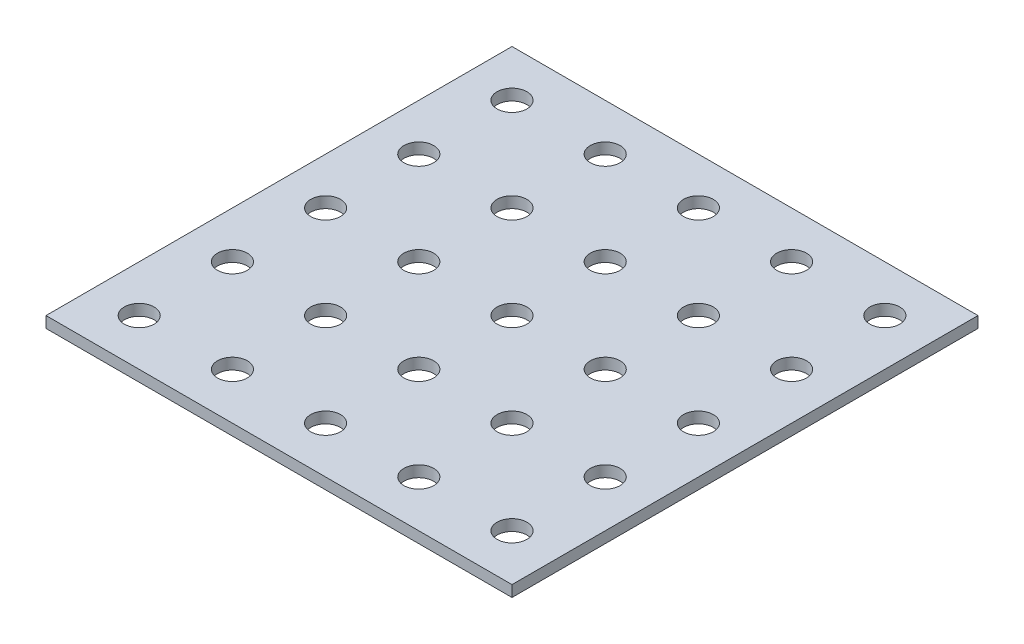
ISO-10303-21;
HEADER;
FILE_DESCRIPTION(('STEP AP214'),'2;1');
FILE_NAME('part.step','',(''),(''),'','','');
FILE_SCHEMA(('AUTOMOTIVE_DESIGN { 1 0 10303 214 1 1 1 1 }'));
ENDSEC;
DATA;
#1=APPLICATION_CONTEXT('core data for automotive mechanical design processes');
#2=APPLICATION_PROTOCOL_DEFINITION('international standard','automotive_design',2000,#1);
#3=PRODUCT_CONTEXT('',#1,'mechanical');
#4=PRODUCT('Part','Part','',(#3));
#5=PRODUCT_RELATED_PRODUCT_CATEGORY('part','',(#4));
#6=PRODUCT_DEFINITION_FORMATION('','',#4);
#7=PRODUCT_DEFINITION_CONTEXT('part definition',#1,'design');
#8=PRODUCT_DEFINITION('design','',#6,#7);
#9=PRODUCT_DEFINITION_SHAPE('','',#8);
#10=(LENGTH_UNIT() NAMED_UNIT(*) SI_UNIT(.MILLI.,.METRE.));
#11=(NAMED_UNIT(*) PLANE_ANGLE_UNIT() SI_UNIT($,.RADIAN.));
#12=(NAMED_UNIT(*) SI_UNIT($,.STERADIAN.) SOLID_ANGLE_UNIT());
#13=UNCERTAINTY_MEASURE_WITH_UNIT(LENGTH_MEASURE(1.E-05),#10,'distance_accuracy_value','');
#14=(GEOMETRIC_REPRESENTATION_CONTEXT(3) GLOBAL_UNCERTAINTY_ASSIGNED_CONTEXT((#13)) GLOBAL_UNIT_ASSIGNED_CONTEXT((#10,
#11,#12)) REPRESENTATION_CONTEXT('',''));
#15=CARTESIAN_POINT('',(0.,0.,0.));
#16=DIRECTION('',(0.,0.,1.));
#17=DIRECTION('',(1.,0.,0.));
#18=AXIS2_PLACEMENT_3D('',#15,#16,#17);
#19=CARTESIAN_POINT('',(-125.,6.,-125.));
#20=DIRECTION('',(1.,0.,0.));
#21=DIRECTION('',(0.,0.,-1.));
#22=AXIS2_PLACEMENT_3D('',#19,#20,#21);
#23=PLANE('',#22);
#24=DIRECTION('',(0.,0.,1.));
#25=VECTOR('',#24,1.);
#26=CARTESIAN_POINT('',(-125.,0.,-125.));
#27=LINE('',#26,#25);
#28=CARTESIAN_POINT('',(-125.,0.,-125.));
#29=VERTEX_POINT('',#28);
#30=CARTESIAN_POINT('',(-125.,0.,125.));
#31=VERTEX_POINT('',#30);
#32=EDGE_CURVE('E99',#29,#31,#27,.T.);
#33=ORIENTED_EDGE('',*,*,#32,.T.);
#34=DIRECTION('',(0.,-1.,0.));
#35=VECTOR('',#34,1.);
#36=CARTESIAN_POINT('',(-125.,6.,125.));
#37=LINE('',#36,#35);
#38=CARTESIAN_POINT('',(-125.,6.,125.));
#39=VERTEX_POINT('',#38);
#40=EDGE_CURVE('E11',#39,#31,#37,.T.);
#41=ORIENTED_EDGE('',*,*,#40,.F.);
#42=DIRECTION('',(0.,0.,1.));
#43=VECTOR('',#42,1.);
#44=CARTESIAN_POINT('',(-125.,6.,-125.));
#45=LINE('',#44,#43);
#46=CARTESIAN_POINT('',(-125.,6.,-125.));
#47=VERTEX_POINT('',#46);
#48=EDGE_CURVE('E87',#47,#39,#45,.T.);
#49=ORIENTED_EDGE('',*,*,#48,.F.);
#50=DIRECTION('',(0.,-1.,0.));
#51=VECTOR('',#50,1.);
#52=CARTESIAN_POINT('',(-125.,6.,-125.));
#53=LINE('',#52,#51);
#54=EDGE_CURVE('E95',#47,#29,#53,.T.);
#55=ORIENTED_EDGE('',*,*,#54,.T.);
#56=EDGE_LOOP('',(#33,#41,#49,#55));
#57=FACE_BOUND('',#56,.T.);
#58=ADVANCED_FACE('F36',(#57),#23,.F.);
#59=CARTESIAN_POINT('',(125.,6.,125.));
#60=DIRECTION('',(0.,0.,-1.));
#61=DIRECTION('',(-1.,0.,0.));
#62=AXIS2_PLACEMENT_3D('',#59,#60,#61);
#63=PLANE('',#62);
#64=DIRECTION('',(1.,0.,0.));
#65=VECTOR('',#64,1.);
#66=CARTESIAN_POINT('',(125.,0.,125.));
#67=LINE('',#66,#65);
#68=CARTESIAN_POINT('',(125.,0.,125.));
#69=VERTEX_POINT('',#68);
#70=EDGE_CURVE('E91',#31,#69,#67,.T.);
#71=ORIENTED_EDGE('',*,*,#70,.T.);
#72=DIRECTION('',(0.,-1.,0.));
#73=VECTOR('',#72,1.);
#74=CARTESIAN_POINT('',(125.,6.,125.));
#75=LINE('',#74,#73);
#76=CARTESIAN_POINT('',(125.,6.,125.));
#77=VERTEX_POINT('',#76);
#78=EDGE_CURVE('E44',#77,#69,#75,.T.);
#79=ORIENTED_EDGE('',*,*,#78,.F.);
#80=DIRECTION('',(1.,0.,0.));
#81=VECTOR('',#80,1.);
#82=CARTESIAN_POINT('',(125.,6.,125.));
#83=LINE('',#82,#81);
#84=EDGE_CURVE('E82',#39,#77,#83,.T.);
#85=ORIENTED_EDGE('',*,*,#84,.F.);
#86=ORIENTED_EDGE('',*,*,#40,.T.);
#87=EDGE_LOOP('',(#71,#79,#85,#86));
#88=FACE_BOUND('',#87,.T.);
#89=ADVANCED_FACE('F90',(#88),#63,.F.);
#90=CARTESIAN_POINT('',(125.,6.,-125.));
#91=DIRECTION('',(-1.,0.,0.));
#92=DIRECTION('',(0.,0.,1.));
#93=AXIS2_PLACEMENT_3D('',#90,#91,#92);
#94=PLANE('',#93);
#95=DIRECTION('',(0.,0.,-1.));
#96=VECTOR('',#95,1.);
#97=CARTESIAN_POINT('',(125.,0.,-125.));
#98=LINE('',#97,#96);
#99=CARTESIAN_POINT('',(125.,0.,-125.));
#100=VERTEX_POINT('',#99);
#101=EDGE_CURVE('E69',#69,#100,#98,.T.);
#102=ORIENTED_EDGE('',*,*,#101,.T.);
#103=DIRECTION('',(0.,-1.,0.));
#104=VECTOR('',#103,1.);
#105=CARTESIAN_POINT('',(125.,6.,-125.));
#106=LINE('',#105,#104);
#107=CARTESIAN_POINT('',(125.,6.,-125.));
#108=VERTEX_POINT('',#107);
#109=EDGE_CURVE('E92',#108,#100,#106,.T.);
#110=ORIENTED_EDGE('',*,*,#109,.F.);
#111=DIRECTION('',(0.,0.,-1.));
#112=VECTOR('',#111,1.);
#113=CARTESIAN_POINT('',(125.,6.,-125.));
#114=LINE('',#113,#112);
#115=EDGE_CURVE('E85',#77,#108,#114,.T.);
#116=ORIENTED_EDGE('',*,*,#115,.F.);
#117=ORIENTED_EDGE('',*,*,#78,.T.);
#118=EDGE_LOOP('',(#102,#110,#116,#117));
#119=FACE_BOUND('',#118,.T.);
#120=ADVANCED_FACE('F93',(#119),#94,.F.);
#121=CARTESIAN_POINT('',(125.,6.,-125.));
#122=DIRECTION('',(0.,0.,1.));
#123=DIRECTION('',(1.,0.,0.));
#124=AXIS2_PLACEMENT_3D('',#121,#122,#123);
#125=PLANE('',#124);
#126=DIRECTION('',(-1.,0.,0.));
#127=VECTOR('',#126,1.);
#128=CARTESIAN_POINT('',(125.,0.,-125.));
#129=LINE('',#128,#127);
#130=EDGE_CURVE('E75',#100,#29,#129,.T.);
#131=ORIENTED_EDGE('',*,*,#130,.T.);
#132=ORIENTED_EDGE('',*,*,#54,.F.);
#133=DIRECTION('',(-1.,0.,0.));
#134=VECTOR('',#133,1.);
#135=CARTESIAN_POINT('',(125.,6.,-125.));
#136=LINE('',#135,#134);
#137=EDGE_CURVE('E52',#108,#47,#136,.T.);
#138=ORIENTED_EDGE('',*,*,#137,.F.);
#139=ORIENTED_EDGE('',*,*,#109,.T.);
#140=EDGE_LOOP('',(#131,#132,#138,#139));
#141=FACE_BOUND('',#140,.T.);
#142=ADVANCED_FACE('F107',(#141),#125,.F.);
#143=CARTESIAN_POINT('',(0.,6.,0.));
#144=DIRECTION('',(0.,-1.,0.));
#145=DIRECTION('',(0.,0.,-1.));
#146=AXIS2_PLACEMENT_3D('',#143,#144,#145);
#147=PLANE('',#146);
#148=CARTESIAN_POINT('',(-50.,6.,100.));
#149=DIRECTION('',(0.,1.,0.));
#150=DIRECTION('',(0.,0.,1.));
#151=AXIS2_PLACEMENT_3D('',#148,#149,#150);
#152=CIRCLE('',#151,8.00000000000001);
#153=CARTESIAN_POINT('',(-50.,6.,108.));
#154=VERTEX_POINT('',#153);
#155=EDGE_CURVE('E210',#154,#154,#152,.T.);
#156=ORIENTED_EDGE('',*,*,#155,.F.);
#157=EDGE_LOOP('',(#156));
#158=FACE_BOUND('',#157,.T.);
#159=CARTESIAN_POINT('',(0.,6.,100.));
#160=DIRECTION('',(0.,1.,0.));
#161=DIRECTION('',(0.,0.,1.));
#162=AXIS2_PLACEMENT_3D('',#159,#160,#161);
#163=CIRCLE('',#162,8.00000000000001);
#164=CARTESIAN_POINT('',(0.,6.,108.));
#165=VERTEX_POINT('',#164);
#166=EDGE_CURVE('E204',#165,#165,#163,.T.);
#167=ORIENTED_EDGE('',*,*,#166,.F.);
#168=EDGE_LOOP('',(#167));
#169=FACE_BOUND('',#168,.T.);
#170=CARTESIAN_POINT('',(50.,6.,100.));
#171=DIRECTION('',(0.,1.,0.));
#172=DIRECTION('',(0.,0.,1.));
#173=AXIS2_PLACEMENT_3D('',#170,#171,#172);
#174=CIRCLE('',#173,8.00000000000001);
#175=CARTESIAN_POINT('',(50.,6.,108.));
#176=VERTEX_POINT('',#175);
#177=EDGE_CURVE('E198',#176,#176,#174,.T.);
#178=ORIENTED_EDGE('',*,*,#177,.F.);
#179=EDGE_LOOP('',(#178));
#180=FACE_BOUND('',#179,.T.);
#181=CARTESIAN_POINT('',(100.,6.,100.));
#182=DIRECTION('',(0.,1.,0.));
#183=DIRECTION('',(0.,0.,1.));
#184=AXIS2_PLACEMENT_3D('',#181,#182,#183);
#185=CIRCLE('',#184,8.00000000000001);
#186=CARTESIAN_POINT('',(100.,6.,108.));
#187=VERTEX_POINT('',#186);
#188=EDGE_CURVE('E192',#187,#187,#185,.T.);
#189=ORIENTED_EDGE('',*,*,#188,.F.);
#190=EDGE_LOOP('',(#189));
#191=FACE_BOUND('',#190,.T.);
#192=CARTESIAN_POINT('',(-50.0000000000002,6.,50.));
#193=DIRECTION('',(0.,1.,0.));
#194=DIRECTION('',(0.,0.,1.));
#195=AXIS2_PLACEMENT_3D('',#192,#193,#194);
#196=CIRCLE('',#195,8.00000000000001);
#197=CARTESIAN_POINT('',(-50.0000000000002,6.,58.));
#198=VERTEX_POINT('',#197);
#199=EDGE_CURVE('E186',#198,#198,#196,.T.);
#200=ORIENTED_EDGE('',*,*,#199,.F.);
#201=EDGE_LOOP('',(#200));
#202=FACE_BOUND('',#201,.T.);
#203=CARTESIAN_POINT('',(-1.66533453693773E-13,6.,50.));
#204=DIRECTION('',(0.,1.,0.));
#205=DIRECTION('',(0.,0.,1.));
#206=AXIS2_PLACEMENT_3D('',#203,#204,#205);
#207=CIRCLE('',#206,8.00000000000001);
#208=CARTESIAN_POINT('',(-1.66533453693773E-13,6.,58.));
#209=VERTEX_POINT('',#208);
#210=EDGE_CURVE('E180',#209,#209,#207,.T.);
#211=ORIENTED_EDGE('',*,*,#210,.F.);
#212=EDGE_LOOP('',(#211));
#213=FACE_BOUND('',#212,.T.);
#214=CARTESIAN_POINT('',(49.9999999999999,6.,50.));
#215=DIRECTION('',(0.,1.,0.));
#216=DIRECTION('',(0.,0.,1.));
#217=AXIS2_PLACEMENT_3D('',#214,#215,#216);
#218=CIRCLE('',#217,8.00000000000001);
#219=CARTESIAN_POINT('',(49.9999999999999,6.,58.));
#220=VERTEX_POINT('',#219);
#221=EDGE_CURVE('E174',#220,#220,#218,.T.);
#222=ORIENTED_EDGE('',*,*,#221,.F.);
#223=EDGE_LOOP('',(#222));
#224=FACE_BOUND('',#223,.T.);
#225=CARTESIAN_POINT('',(99.9999999999998,6.,50.));
#226=DIRECTION('',(0.,1.,0.));
#227=DIRECTION('',(0.,0.,1.));
#228=AXIS2_PLACEMENT_3D('',#225,#226,#227);
#229=CIRCLE('',#228,8.00000000000001);
#230=CARTESIAN_POINT('',(99.9999999999998,6.,58.));
#231=VERTEX_POINT('',#230);
#232=EDGE_CURVE('E168',#231,#231,#229,.T.);
#233=ORIENTED_EDGE('',*,*,#232,.F.);
#234=EDGE_LOOP('',(#233));
#235=FACE_BOUND('',#234,.T.);
#236=CARTESIAN_POINT('',(-50.0000000000003,6.,0.));
#237=DIRECTION('',(0.,1.,0.));
#238=DIRECTION('',(0.,0.,1.));
#239=AXIS2_PLACEMENT_3D('',#236,#237,#238);
#240=CIRCLE('',#239,8.00000000000001);
#241=CARTESIAN_POINT('',(-50.0000000000003,6.,7.99999999999999));
#242=VERTEX_POINT('',#241);
#243=EDGE_CURVE('E162',#242,#242,#240,.T.);
#244=ORIENTED_EDGE('',*,*,#243,.F.);
#245=EDGE_LOOP('',(#244));
#246=FACE_BOUND('',#245,.T.);
#247=CARTESIAN_POINT('',(-3.46944695195361E-13,6.,0.));
#248=DIRECTION('',(0.,1.,0.));
#249=DIRECTION('',(0.,0.,1.));
#250=AXIS2_PLACEMENT_3D('',#247,#248,#249);
#251=CIRCLE('',#250,8.00000000000001);
#252=CARTESIAN_POINT('',(-3.46944695195361E-13,6.,7.99999999999999));
#253=VERTEX_POINT('',#252);
#254=EDGE_CURVE('E156',#253,#253,#251,.T.);
#255=ORIENTED_EDGE('',*,*,#254,.F.);
#256=EDGE_LOOP('',(#255));
#257=FACE_BOUND('',#256,.T.);
#258=CARTESIAN_POINT('',(49.9999999999997,6.,0.));
#259=DIRECTION('',(0.,1.,0.));
#260=DIRECTION('',(0.,0.,1.));
#261=AXIS2_PLACEMENT_3D('',#258,#259,#260);
#262=CIRCLE('',#261,8.00000000000001);
#263=CARTESIAN_POINT('',(49.9999999999997,6.,7.99999999999999));
#264=VERTEX_POINT('',#263);
#265=EDGE_CURVE('E150',#264,#264,#262,.T.);
#266=ORIENTED_EDGE('',*,*,#265,.F.);
#267=EDGE_LOOP('',(#266));
#268=FACE_BOUND('',#267,.T.);
#269=CARTESIAN_POINT('',(99.9999999999997,6.,0.));
#270=DIRECTION('',(0.,1.,0.));
#271=DIRECTION('',(0.,0.,1.));
#272=AXIS2_PLACEMENT_3D('',#269,#270,#271);
#273=CIRCLE('',#272,8.00000000000001);
#274=CARTESIAN_POINT('',(99.9999999999997,6.,7.99999999999999));
#275=VERTEX_POINT('',#274);
#276=EDGE_CURVE('E144',#275,#275,#273,.T.);
#277=ORIENTED_EDGE('',*,*,#276,.F.);
#278=EDGE_LOOP('',(#277));
#279=FACE_BOUND('',#278,.T.);
#280=CARTESIAN_POINT('',(-50.0000000000005,6.,-50.));
#281=DIRECTION('',(0.,1.,0.));
#282=DIRECTION('',(0.,0.,1.));
#283=AXIS2_PLACEMENT_3D('',#280,#281,#282);
#284=CIRCLE('',#283,8.00000000000001);
#285=CARTESIAN_POINT('',(-50.0000000000005,6.,-42.));
#286=VERTEX_POINT('',#285);
#287=EDGE_CURVE('E138',#286,#286,#284,.T.);
#288=ORIENTED_EDGE('',*,*,#287,.F.);
#289=EDGE_LOOP('',(#288));
#290=FACE_BOUND('',#289,.T.);
#291=CARTESIAN_POINT('',(-5.13478148889135E-13,6.,-50.));
#292=DIRECTION('',(0.,1.,0.));
#293=DIRECTION('',(0.,0.,1.));
#294=AXIS2_PLACEMENT_3D('',#291,#292,#293);
#295=CIRCLE('',#294,8.00000000000001);
#296=CARTESIAN_POINT('',(-5.13478148889135E-13,6.,-42.));
#297=VERTEX_POINT('',#296);
#298=EDGE_CURVE('E132',#297,#297,#295,.T.);
#299=ORIENTED_EDGE('',*,*,#298,.F.);
#300=EDGE_LOOP('',(#299));
#301=FACE_BOUND('',#300,.T.);
#302=CARTESIAN_POINT('',(49.9999999999995,6.,-50.));
#303=DIRECTION('',(0.,1.,0.));
#304=DIRECTION('',(0.,0.,1.));
#305=AXIS2_PLACEMENT_3D('',#302,#303,#304);
#306=CIRCLE('',#305,8.00000000000001);
#307=CARTESIAN_POINT('',(49.9999999999995,6.,-42.));
#308=VERTEX_POINT('',#307);
#309=EDGE_CURVE('E126',#308,#308,#306,.T.);
#310=ORIENTED_EDGE('',*,*,#309,.F.);
#311=EDGE_LOOP('',(#310));
#312=FACE_BOUND('',#311,.T.);
#313=CARTESIAN_POINT('',(99.9999999999995,6.,-50.));
#314=DIRECTION('',(0.,1.,0.));
#315=DIRECTION('',(0.,0.,1.));
#316=AXIS2_PLACEMENT_3D('',#313,#314,#315);
#317=CIRCLE('',#316,8.00000000000001);
#318=CARTESIAN_POINT('',(99.9999999999995,6.,-42.));
#319=VERTEX_POINT('',#318);
#320=EDGE_CURVE('E119',#319,#319,#317,.T.);
#321=ORIENTED_EDGE('',*,*,#320,.F.);
#322=EDGE_LOOP('',(#321));
#323=FACE_BOUND('',#322,.T.);
#324=CARTESIAN_POINT('',(-50.0000000000007,6.,-100.));
#325=DIRECTION('',(0.,1.,0.));
#326=DIRECTION('',(0.,0.,1.));
#327=AXIS2_PLACEMENT_3D('',#324,#325,#326);
#328=CIRCLE('',#327,8.00000000000001);
#329=CARTESIAN_POINT('',(-50.0000000000007,6.,-92.));
#330=VERTEX_POINT('',#329);
#331=EDGE_CURVE('E257',#330,#330,#328,.T.);
#332=ORIENTED_EDGE('',*,*,#331,.F.);
#333=EDGE_LOOP('',(#332));
#334=FACE_BOUND('',#333,.T.);
#335=CARTESIAN_POINT('',(-6.80011602582908E-13,6.,-100.));
#336=DIRECTION('',(0.,1.,0.));
#337=DIRECTION('',(0.,0.,1.));
#338=AXIS2_PLACEMENT_3D('',#335,#336,#337);
#339=CIRCLE('',#338,8.00000000000001);
#340=CARTESIAN_POINT('',(-6.80011602582908E-13,6.,-92.));
#341=VERTEX_POINT('',#340);
#342=EDGE_CURVE('E251',#341,#341,#339,.T.);
#343=ORIENTED_EDGE('',*,*,#342,.F.);
#344=EDGE_LOOP('',(#343));
#345=FACE_BOUND('',#344,.T.);
#346=CARTESIAN_POINT('',(49.9999999999993,6.,-100.));
#347=DIRECTION('',(0.,1.,0.));
#348=DIRECTION('',(0.,0.,1.));
#349=AXIS2_PLACEMENT_3D('',#346,#347,#348);
#350=CIRCLE('',#349,8.00000000000001);
#351=CARTESIAN_POINT('',(49.9999999999993,6.,-92.));
#352=VERTEX_POINT('',#351);
#353=EDGE_CURVE('E245',#352,#352,#350,.T.);
#354=ORIENTED_EDGE('',*,*,#353,.F.);
#355=EDGE_LOOP('',(#354));
#356=FACE_BOUND('',#355,.T.);
#357=CARTESIAN_POINT('',(99.9999999999993,6.,-100.));
#358=DIRECTION('',(0.,1.,0.));
#359=DIRECTION('',(0.,0.,1.));
#360=AXIS2_PLACEMENT_3D('',#357,#358,#359);
#361=CIRCLE('',#360,8.00000000000001);
#362=CARTESIAN_POINT('',(99.9999999999993,6.,-92.));
#363=VERTEX_POINT('',#362);
#364=EDGE_CURVE('E239',#363,#363,#361,.T.);
#365=ORIENTED_EDGE('',*,*,#364,.F.);
#366=EDGE_LOOP('',(#365));
#367=FACE_BOUND('',#366,.T.);
#368=CARTESIAN_POINT('',(-100.,6.,50.));
#369=DIRECTION('',(0.,1.,0.));
#370=DIRECTION('',(0.,0.,1.));
#371=AXIS2_PLACEMENT_3D('',#368,#369,#370);
#372=CIRCLE('',#371,8.00000000000001);
#373=CARTESIAN_POINT('',(-100.,6.,58.));
#374=VERTEX_POINT('',#373);
#375=EDGE_CURVE('E233',#374,#374,#372,.T.);
#376=ORIENTED_EDGE('',*,*,#375,.F.);
#377=EDGE_LOOP('',(#376));
#378=FACE_BOUND('',#377,.T.);
#379=CARTESIAN_POINT('',(-100.,6.,0.));
#380=DIRECTION('',(0.,1.,0.));
#381=DIRECTION('',(0.,0.,1.));
#382=AXIS2_PLACEMENT_3D('',#379,#380,#381);
#383=CIRCLE('',#382,8.00000000000001);
#384=CARTESIAN_POINT('',(-100.,6.,7.99999999999999));
#385=VERTEX_POINT('',#384);
#386=EDGE_CURVE('E227',#385,#385,#383,.T.);
#387=ORIENTED_EDGE('',*,*,#386,.F.);
#388=EDGE_LOOP('',(#387));
#389=FACE_BOUND('',#388,.T.);
#390=CARTESIAN_POINT('',(-100.000000000001,6.,-50.));
#391=DIRECTION('',(0.,1.,0.));
#392=DIRECTION('',(0.,0.,1.));
#393=AXIS2_PLACEMENT_3D('',#390,#391,#392);
#394=CIRCLE('',#393,8.00000000000001);
#395=CARTESIAN_POINT('',(-100.000000000001,6.,-42.));
#396=VERTEX_POINT('',#395);
#397=EDGE_CURVE('E221',#396,#396,#394,.T.);
#398=ORIENTED_EDGE('',*,*,#397,.F.);
#399=EDGE_LOOP('',(#398));
#400=FACE_BOUND('',#399,.T.);
#401=CARTESIAN_POINT('',(-100.000000000001,6.,-100.));
#402=DIRECTION('',(0.,1.,0.));
#403=DIRECTION('',(0.,0.,1.));
#404=AXIS2_PLACEMENT_3D('',#401,#402,#403);
#405=CIRCLE('',#404,8.00000000000001);
#406=CARTESIAN_POINT('',(-100.000000000001,6.,-92.));
#407=VERTEX_POINT('',#406);
#408=EDGE_CURVE('E215',#407,#407,#405,.T.);
#409=ORIENTED_EDGE('',*,*,#408,.F.);
#410=EDGE_LOOP('',(#409));
#411=FACE_BOUND('',#410,.T.);
#412=CARTESIAN_POINT('',(-100.,6.,100.));
#413=DIRECTION('',(0.,1.,0.));
#414=DIRECTION('',(0.,0.,1.));
#415=AXIS2_PLACEMENT_3D('',#412,#413,#414);
#416=CIRCLE('',#415,8.00000000000001);
#417=CARTESIAN_POINT('',(-100.,6.,108.));
#418=VERTEX_POINT('',#417);
#419=EDGE_CURVE('E113',#418,#418,#416,.T.);
#420=ORIENTED_EDGE('',*,*,#419,.F.);
#421=EDGE_LOOP('',(#420));
#422=FACE_BOUND('',#421,.T.);
#423=ORIENTED_EDGE('',*,*,#48,.T.);
#424=ORIENTED_EDGE('',*,*,#84,.T.);
#425=ORIENTED_EDGE('',*,*,#115,.T.);
#426=ORIENTED_EDGE('',*,*,#137,.T.);
#427=EDGE_LOOP('',(#423,#424,#425,#426));
#428=FACE_BOUND('',#427,.T.);
#429=ADVANCED_FACE('F83',(#158,#169,#180,#191,#202,#213,#224,#235,#246,#257,#268,#279,#290,#301,
#312,#323,#334,#345,#356,#367,#378,#389,#400,#411,#422,#428),#147,.F.);
#430=CARTESIAN_POINT('',(0.,0.,0.));
#431=DIRECTION('',(0.,-1.,0.));
#432=DIRECTION('',(0.,0.,-1.));
#433=AXIS2_PLACEMENT_3D('',#430,#431,#432);
#434=PLANE('',#433);
#435=CARTESIAN_POINT('',(-50.,0.,100.));
#436=DIRECTION('',(0.,1.,0.));
#437=DIRECTION('',(0.,0.,1.));
#438=AXIS2_PLACEMENT_3D('',#435,#436,#437);
#439=CIRCLE('',#438,8.00000000000001);
#440=CARTESIAN_POINT('',(-50.,0.,108.));
#441=VERTEX_POINT('',#440);
#442=EDGE_CURVE('E116',#441,#441,#439,.T.);
#443=ORIENTED_EDGE('',*,*,#442,.T.);
#444=EDGE_LOOP('',(#443));
#445=FACE_BOUND('',#444,.T.);
#446=CARTESIAN_POINT('',(0.,0.,100.));
#447=DIRECTION('',(0.,1.,0.));
#448=DIRECTION('',(0.,0.,1.));
#449=AXIS2_PLACEMENT_3D('',#446,#447,#448);
#450=CIRCLE('',#449,8.00000000000001);
#451=CARTESIAN_POINT('',(0.,0.,108.));
#452=VERTEX_POINT('',#451);
#453=EDGE_CURVE('E207',#452,#452,#450,.T.);
#454=ORIENTED_EDGE('',*,*,#453,.T.);
#455=EDGE_LOOP('',(#454));
#456=FACE_BOUND('',#455,.T.);
#457=CARTESIAN_POINT('',(50.,0.,100.));
#458=DIRECTION('',(0.,1.,0.));
#459=DIRECTION('',(0.,0.,1.));
#460=AXIS2_PLACEMENT_3D('',#457,#458,#459);
#461=CIRCLE('',#460,8.00000000000001);
#462=CARTESIAN_POINT('',(50.,0.,108.));
#463=VERTEX_POINT('',#462);
#464=EDGE_CURVE('E201',#463,#463,#461,.T.);
#465=ORIENTED_EDGE('',*,*,#464,.T.);
#466=EDGE_LOOP('',(#465));
#467=FACE_BOUND('',#466,.T.);
#468=CARTESIAN_POINT('',(100.,0.,100.));
#469=DIRECTION('',(0.,1.,0.));
#470=DIRECTION('',(0.,0.,1.));
#471=AXIS2_PLACEMENT_3D('',#468,#469,#470);
#472=CIRCLE('',#471,8.00000000000001);
#473=CARTESIAN_POINT('',(100.,0.,108.));
#474=VERTEX_POINT('',#473);
#475=EDGE_CURVE('E195',#474,#474,#472,.T.);
#476=ORIENTED_EDGE('',*,*,#475,.T.);
#477=EDGE_LOOP('',(#476));
#478=FACE_BOUND('',#477,.T.);
#479=CARTESIAN_POINT('',(-50.0000000000002,0.,50.));
#480=DIRECTION('',(0.,1.,0.));
#481=DIRECTION('',(0.,0.,1.));
#482=AXIS2_PLACEMENT_3D('',#479,#480,#481);
#483=CIRCLE('',#482,8.00000000000001);
#484=CARTESIAN_POINT('',(-50.0000000000002,0.,58.));
#485=VERTEX_POINT('',#484);
#486=EDGE_CURVE('E189',#485,#485,#483,.T.);
#487=ORIENTED_EDGE('',*,*,#486,.T.);
#488=EDGE_LOOP('',(#487));
#489=FACE_BOUND('',#488,.T.);
#490=CARTESIAN_POINT('',(-1.66533453693773E-13,0.,50.));
#491=DIRECTION('',(0.,1.,0.));
#492=DIRECTION('',(0.,0.,1.));
#493=AXIS2_PLACEMENT_3D('',#490,#491,#492);
#494=CIRCLE('',#493,8.00000000000001);
#495=CARTESIAN_POINT('',(-1.66533453693773E-13,0.,58.));
#496=VERTEX_POINT('',#495);
#497=EDGE_CURVE('E183',#496,#496,#494,.T.);
#498=ORIENTED_EDGE('',*,*,#497,.T.);
#499=EDGE_LOOP('',(#498));
#500=FACE_BOUND('',#499,.T.);
#501=CARTESIAN_POINT('',(49.9999999999999,0.,50.));
#502=DIRECTION('',(0.,1.,0.));
#503=DIRECTION('',(0.,0.,1.));
#504=AXIS2_PLACEMENT_3D('',#501,#502,#503);
#505=CIRCLE('',#504,8.00000000000001);
#506=CARTESIAN_POINT('',(49.9999999999999,0.,58.));
#507=VERTEX_POINT('',#506);
#508=EDGE_CURVE('E177',#507,#507,#505,.T.);
#509=ORIENTED_EDGE('',*,*,#508,.T.);
#510=EDGE_LOOP('',(#509));
#511=FACE_BOUND('',#510,.T.);
#512=CARTESIAN_POINT('',(99.9999999999998,0.,50.));
#513=DIRECTION('',(0.,1.,0.));
#514=DIRECTION('',(0.,0.,1.));
#515=AXIS2_PLACEMENT_3D('',#512,#513,#514);
#516=CIRCLE('',#515,8.00000000000001);
#517=CARTESIAN_POINT('',(99.9999999999998,0.,58.));
#518=VERTEX_POINT('',#517);
#519=EDGE_CURVE('E171',#518,#518,#516,.T.);
#520=ORIENTED_EDGE('',*,*,#519,.T.);
#521=EDGE_LOOP('',(#520));
#522=FACE_BOUND('',#521,.T.);
#523=CARTESIAN_POINT('',(-50.0000000000003,0.,0.));
#524=DIRECTION('',(0.,1.,0.));
#525=DIRECTION('',(0.,0.,1.));
#526=AXIS2_PLACEMENT_3D('',#523,#524,#525);
#527=CIRCLE('',#526,8.00000000000001);
#528=CARTESIAN_POINT('',(-50.0000000000003,0.,7.99999999999999));
#529=VERTEX_POINT('',#528);
#530=EDGE_CURVE('E165',#529,#529,#527,.T.);
#531=ORIENTED_EDGE('',*,*,#530,.T.);
#532=EDGE_LOOP('',(#531));
#533=FACE_BOUND('',#532,.T.);
#534=CARTESIAN_POINT('',(-3.46944695195361E-13,0.,0.));
#535=DIRECTION('',(0.,1.,0.));
#536=DIRECTION('',(0.,0.,1.));
#537=AXIS2_PLACEMENT_3D('',#534,#535,#536);
#538=CIRCLE('',#537,8.00000000000001);
#539=CARTESIAN_POINT('',(-3.46944695195361E-13,0.,7.99999999999999));
#540=VERTEX_POINT('',#539);
#541=EDGE_CURVE('E159',#540,#540,#538,.T.);
#542=ORIENTED_EDGE('',*,*,#541,.T.);
#543=EDGE_LOOP('',(#542));
#544=FACE_BOUND('',#543,.T.);
#545=CARTESIAN_POINT('',(49.9999999999997,0.,0.));
#546=DIRECTION('',(0.,1.,0.));
#547=DIRECTION('',(0.,0.,1.));
#548=AXIS2_PLACEMENT_3D('',#545,#546,#547);
#549=CIRCLE('',#548,8.00000000000001);
#550=CARTESIAN_POINT('',(49.9999999999997,0.,7.99999999999999));
#551=VERTEX_POINT('',#550);
#552=EDGE_CURVE('E153',#551,#551,#549,.T.);
#553=ORIENTED_EDGE('',*,*,#552,.T.);
#554=EDGE_LOOP('',(#553));
#555=FACE_BOUND('',#554,.T.);
#556=CARTESIAN_POINT('',(99.9999999999997,0.,0.));
#557=DIRECTION('',(0.,1.,0.));
#558=DIRECTION('',(0.,0.,1.));
#559=AXIS2_PLACEMENT_3D('',#556,#557,#558);
#560=CIRCLE('',#559,8.00000000000001);
#561=CARTESIAN_POINT('',(99.9999999999997,0.,7.99999999999999));
#562=VERTEX_POINT('',#561);
#563=EDGE_CURVE('E147',#562,#562,#560,.T.);
#564=ORIENTED_EDGE('',*,*,#563,.T.);
#565=EDGE_LOOP('',(#564));
#566=FACE_BOUND('',#565,.T.);
#567=CARTESIAN_POINT('',(-50.0000000000005,0.,-50.));
#568=DIRECTION('',(0.,1.,0.));
#569=DIRECTION('',(0.,0.,1.));
#570=AXIS2_PLACEMENT_3D('',#567,#568,#569);
#571=CIRCLE('',#570,8.00000000000001);
#572=CARTESIAN_POINT('',(-50.0000000000005,0.,-42.));
#573=VERTEX_POINT('',#572);
#574=EDGE_CURVE('E141',#573,#573,#571,.T.);
#575=ORIENTED_EDGE('',*,*,#574,.T.);
#576=EDGE_LOOP('',(#575));
#577=FACE_BOUND('',#576,.T.);
#578=CARTESIAN_POINT('',(-5.13478148889135E-13,0.,-50.));
#579=DIRECTION('',(0.,1.,0.));
#580=DIRECTION('',(0.,0.,1.));
#581=AXIS2_PLACEMENT_3D('',#578,#579,#580);
#582=CIRCLE('',#581,8.00000000000001);
#583=CARTESIAN_POINT('',(-5.13478148889135E-13,0.,-42.));
#584=VERTEX_POINT('',#583);
#585=EDGE_CURVE('E135',#584,#584,#582,.T.);
#586=ORIENTED_EDGE('',*,*,#585,.T.);
#587=EDGE_LOOP('',(#586));
#588=FACE_BOUND('',#587,.T.);
#589=CARTESIAN_POINT('',(49.9999999999995,0.,-50.));
#590=DIRECTION('',(0.,1.,0.));
#591=DIRECTION('',(0.,0.,1.));
#592=AXIS2_PLACEMENT_3D('',#589,#590,#591);
#593=CIRCLE('',#592,8.00000000000001);
#594=CARTESIAN_POINT('',(49.9999999999995,0.,-42.));
#595=VERTEX_POINT('',#594);
#596=EDGE_CURVE('E129',#595,#595,#593,.T.);
#597=ORIENTED_EDGE('',*,*,#596,.T.);
#598=EDGE_LOOP('',(#597));
#599=FACE_BOUND('',#598,.T.);
#600=CARTESIAN_POINT('',(99.9999999999995,0.,-50.));
#601=DIRECTION('',(0.,1.,0.));
#602=DIRECTION('',(0.,0.,1.));
#603=AXIS2_PLACEMENT_3D('',#600,#601,#602);
#604=CIRCLE('',#603,8.00000000000001);
#605=CARTESIAN_POINT('',(99.9999999999995,0.,-42.));
#606=VERTEX_POINT('',#605);
#607=EDGE_CURVE('E122',#606,#606,#604,.T.);
#608=ORIENTED_EDGE('',*,*,#607,.T.);
#609=EDGE_LOOP('',(#608));
#610=FACE_BOUND('',#609,.T.);
#611=CARTESIAN_POINT('',(-50.0000000000007,0.,-100.));
#612=DIRECTION('',(0.,1.,0.));
#613=DIRECTION('',(0.,0.,1.));
#614=AXIS2_PLACEMENT_3D('',#611,#612,#613);
#615=CIRCLE('',#614,8.00000000000001);
#616=CARTESIAN_POINT('',(-50.0000000000007,0.,-92.));
#617=VERTEX_POINT('',#616);
#618=EDGE_CURVE('E123',#617,#617,#615,.T.);
#619=ORIENTED_EDGE('',*,*,#618,.T.);
#620=EDGE_LOOP('',(#619));
#621=FACE_BOUND('',#620,.T.);
#622=CARTESIAN_POINT('',(-6.80011602582908E-13,0.,-100.));
#623=DIRECTION('',(0.,1.,0.));
#624=DIRECTION('',(0.,0.,1.));
#625=AXIS2_PLACEMENT_3D('',#622,#623,#624);
#626=CIRCLE('',#625,8.00000000000001);
#627=CARTESIAN_POINT('',(-6.80011602582908E-13,0.,-92.));
#628=VERTEX_POINT('',#627);
#629=EDGE_CURVE('E254',#628,#628,#626,.T.);
#630=ORIENTED_EDGE('',*,*,#629,.T.);
#631=EDGE_LOOP('',(#630));
#632=FACE_BOUND('',#631,.T.);
#633=CARTESIAN_POINT('',(49.9999999999993,0.,-100.));
#634=DIRECTION('',(0.,1.,0.));
#635=DIRECTION('',(0.,0.,1.));
#636=AXIS2_PLACEMENT_3D('',#633,#634,#635);
#637=CIRCLE('',#636,8.00000000000001);
#638=CARTESIAN_POINT('',(49.9999999999993,0.,-92.));
#639=VERTEX_POINT('',#638);
#640=EDGE_CURVE('E248',#639,#639,#637,.T.);
#641=ORIENTED_EDGE('',*,*,#640,.T.);
#642=EDGE_LOOP('',(#641));
#643=FACE_BOUND('',#642,.T.);
#644=CARTESIAN_POINT('',(99.9999999999993,0.,-100.));
#645=DIRECTION('',(0.,1.,0.));
#646=DIRECTION('',(0.,0.,1.));
#647=AXIS2_PLACEMENT_3D('',#644,#645,#646);
#648=CIRCLE('',#647,8.00000000000001);
#649=CARTESIAN_POINT('',(99.9999999999993,0.,-92.));
#650=VERTEX_POINT('',#649);
#651=EDGE_CURVE('E242',#650,#650,#648,.T.);
#652=ORIENTED_EDGE('',*,*,#651,.T.);
#653=EDGE_LOOP('',(#652));
#654=FACE_BOUND('',#653,.T.);
#655=CARTESIAN_POINT('',(-100.,0.,50.));
#656=DIRECTION('',(0.,1.,0.));
#657=DIRECTION('',(0.,0.,1.));
#658=AXIS2_PLACEMENT_3D('',#655,#656,#657);
#659=CIRCLE('',#658,8.00000000000001);
#660=CARTESIAN_POINT('',(-100.,0.,58.));
#661=VERTEX_POINT('',#660);
#662=EDGE_CURVE('E236',#661,#661,#659,.T.);
#663=ORIENTED_EDGE('',*,*,#662,.T.);
#664=EDGE_LOOP('',(#663));
#665=FACE_BOUND('',#664,.T.);
#666=CARTESIAN_POINT('',(-100.,0.,0.));
#667=DIRECTION('',(0.,1.,0.));
#668=DIRECTION('',(0.,0.,1.));
#669=AXIS2_PLACEMENT_3D('',#666,#667,#668);
#670=CIRCLE('',#669,8.00000000000001);
#671=CARTESIAN_POINT('',(-100.,0.,7.99999999999999));
#672=VERTEX_POINT('',#671);
#673=EDGE_CURVE('E230',#672,#672,#670,.T.);
#674=ORIENTED_EDGE('',*,*,#673,.T.);
#675=EDGE_LOOP('',(#674));
#676=FACE_BOUND('',#675,.T.);
#677=CARTESIAN_POINT('',(-100.000000000001,0.,-50.));
#678=DIRECTION('',(0.,1.,0.));
#679=DIRECTION('',(0.,0.,1.));
#680=AXIS2_PLACEMENT_3D('',#677,#678,#679);
#681=CIRCLE('',#680,8.00000000000001);
#682=CARTESIAN_POINT('',(-100.000000000001,0.,-42.));
#683=VERTEX_POINT('',#682);
#684=EDGE_CURVE('E224',#683,#683,#681,.T.);
#685=ORIENTED_EDGE('',*,*,#684,.T.);
#686=EDGE_LOOP('',(#685));
#687=FACE_BOUND('',#686,.T.);
#688=CARTESIAN_POINT('',(-100.000000000001,0.,-100.));
#689=DIRECTION('',(0.,1.,0.));
#690=DIRECTION('',(0.,0.,1.));
#691=AXIS2_PLACEMENT_3D('',#688,#689,#690);
#692=CIRCLE('',#691,8.00000000000001);
#693=CARTESIAN_POINT('',(-100.000000000001,0.,-92.));
#694=VERTEX_POINT('',#693);
#695=EDGE_CURVE('E218',#694,#694,#692,.T.);
#696=ORIENTED_EDGE('',*,*,#695,.T.);
#697=EDGE_LOOP('',(#696));
#698=FACE_BOUND('',#697,.T.);
#699=CARTESIAN_POINT('',(-100.,0.,100.));
#700=DIRECTION('',(0.,1.,0.));
#701=DIRECTION('',(0.,0.,1.));
#702=AXIS2_PLACEMENT_3D('',#699,#700,#701);
#703=CIRCLE('',#702,8.00000000000001);
#704=CARTESIAN_POINT('',(-100.,0.,108.));
#705=VERTEX_POINT('',#704);
#706=EDGE_CURVE('E102',#705,#705,#703,.T.);
#707=ORIENTED_EDGE('',*,*,#706,.T.);
#708=EDGE_LOOP('',(#707));
#709=FACE_BOUND('',#708,.T.);
#710=ORIENTED_EDGE('',*,*,#32,.F.);
#711=ORIENTED_EDGE('',*,*,#130,.F.);
#712=ORIENTED_EDGE('',*,*,#101,.F.);
#713=ORIENTED_EDGE('',*,*,#70,.F.);
#714=EDGE_LOOP('',(#710,#711,#712,#713));
#715=FACE_BOUND('',#714,.T.);
#716=ADVANCED_FACE('F110',(#445,#456,#467,#478,#489,#500,#511,#522,#533,#544,#555,#566,#577,
#588,#599,#610,#621,#632,#643,#654,#665,#676,#687,#698,#709,#715),#434,.T.);
#717=CARTESIAN_POINT('',(-100.,0.,100.));
#718=DIRECTION('',(0.,1.,0.));
#719=DIRECTION('',(0.,0.,1.));
#720=AXIS2_PLACEMENT_3D('',#717,#718,#719);
#721=CYLINDRICAL_SURFACE('',#720,8.00000000000001);
#722=ORIENTED_EDGE('',*,*,#706,.F.);
#723=EDGE_LOOP('',(#722));
#724=FACE_BOUND('',#723,.T.);
#725=ORIENTED_EDGE('',*,*,#419,.T.);
#726=EDGE_LOOP('',(#725));
#727=FACE_BOUND('',#726,.T.);
#728=ADVANCED_FACE('F293',(#724,#727),#721,.F.);
#729=CARTESIAN_POINT('',(-100.000000000001,0.,-100.));
#730=DIRECTION('',(0.,1.,0.));
#731=DIRECTION('',(0.,0.,1.));
#732=AXIS2_PLACEMENT_3D('',#729,#730,#731);
#733=CYLINDRICAL_SURFACE('',#732,8.00000000000001);
#734=ORIENTED_EDGE('',*,*,#695,.F.);
#735=EDGE_LOOP('',(#734));
#736=FACE_BOUND('',#735,.T.);
#737=ORIENTED_EDGE('',*,*,#408,.T.);
#738=EDGE_LOOP('',(#737));
#739=FACE_BOUND('',#738,.T.);
#740=ADVANCED_FACE('F295',(#736,#739),#733,.F.);
#741=CARTESIAN_POINT('',(-100.000000000001,0.,-50.));
#742=DIRECTION('',(0.,1.,0.));
#743=DIRECTION('',(0.,0.,1.));
#744=AXIS2_PLACEMENT_3D('',#741,#742,#743);
#745=CYLINDRICAL_SURFACE('',#744,8.00000000000001);
#746=ORIENTED_EDGE('',*,*,#684,.F.);
#747=EDGE_LOOP('',(#746));
#748=FACE_BOUND('',#747,.T.);
#749=ORIENTED_EDGE('',*,*,#397,.T.);
#750=EDGE_LOOP('',(#749));
#751=FACE_BOUND('',#750,.T.);
#752=ADVANCED_FACE('F302',(#748,#751),#745,.F.);
#753=CARTESIAN_POINT('',(-100.,0.,0.));
#754=DIRECTION('',(0.,1.,0.));
#755=DIRECTION('',(0.,0.,1.));
#756=AXIS2_PLACEMENT_3D('',#753,#754,#755);
#757=CYLINDRICAL_SURFACE('',#756,8.00000000000001);
#758=ORIENTED_EDGE('',*,*,#673,.F.);
#759=EDGE_LOOP('',(#758));
#760=FACE_BOUND('',#759,.T.);
#761=ORIENTED_EDGE('',*,*,#386,.T.);
#762=EDGE_LOOP('',(#761));
#763=FACE_BOUND('',#762,.T.);
#764=ADVANCED_FACE('F350',(#760,#763),#757,.F.);
#765=CARTESIAN_POINT('',(-100.,0.,50.));
#766=DIRECTION('',(0.,1.,0.));
#767=DIRECTION('',(0.,0.,1.));
#768=AXIS2_PLACEMENT_3D('',#765,#766,#767);
#769=CYLINDRICAL_SURFACE('',#768,8.00000000000001);
#770=ORIENTED_EDGE('',*,*,#662,.F.);
#771=EDGE_LOOP('',(#770));
#772=FACE_BOUND('',#771,.T.);
#773=ORIENTED_EDGE('',*,*,#375,.T.);
#774=EDGE_LOOP('',(#773));
#775=FACE_BOUND('',#774,.T.);
#776=ADVANCED_FACE('F360',(#772,#775),#769,.F.);
#777=CARTESIAN_POINT('',(99.9999999999993,0.,-100.));
#778=DIRECTION('',(0.,1.,0.));
#779=DIRECTION('',(0.,0.,1.));
#780=AXIS2_PLACEMENT_3D('',#777,#778,#779);
#781=CYLINDRICAL_SURFACE('',#780,8.00000000000001);
#782=ORIENTED_EDGE('',*,*,#651,.F.);
#783=EDGE_LOOP('',(#782));
#784=FACE_BOUND('',#783,.T.);
#785=ORIENTED_EDGE('',*,*,#364,.T.);
#786=EDGE_LOOP('',(#785));
#787=FACE_BOUND('',#786,.T.);
#788=ADVANCED_FACE('F370',(#784,#787),#781,.F.);
#789=CARTESIAN_POINT('',(49.9999999999993,0.,-100.));
#790=DIRECTION('',(0.,1.,0.));
#791=DIRECTION('',(0.,0.,1.));
#792=AXIS2_PLACEMENT_3D('',#789,#790,#791);
#793=CYLINDRICAL_SURFACE('',#792,8.00000000000001);
#794=ORIENTED_EDGE('',*,*,#640,.F.);
#795=EDGE_LOOP('',(#794));
#796=FACE_BOUND('',#795,.T.);
#797=ORIENTED_EDGE('',*,*,#353,.T.);
#798=EDGE_LOOP('',(#797));
#799=FACE_BOUND('',#798,.T.);
#800=ADVANCED_FACE('F380',(#796,#799),#793,.F.);
#801=CARTESIAN_POINT('',(-6.80011602582908E-13,0.,-100.));
#802=DIRECTION('',(0.,1.,0.));
#803=DIRECTION('',(0.,0.,1.));
#804=AXIS2_PLACEMENT_3D('',#801,#802,#803);
#805=CYLINDRICAL_SURFACE('',#804,8.00000000000001);
#806=ORIENTED_EDGE('',*,*,#629,.F.);
#807=EDGE_LOOP('',(#806));
#808=FACE_BOUND('',#807,.T.);
#809=ORIENTED_EDGE('',*,*,#342,.T.);
#810=EDGE_LOOP('',(#809));
#811=FACE_BOUND('',#810,.T.);
#812=ADVANCED_FACE('F269',(#808,#811),#805,.F.);
#813=CARTESIAN_POINT('',(-50.0000000000007,0.,-100.));
#814=DIRECTION('',(0.,1.,0.));
#815=DIRECTION('',(0.,0.,1.));
#816=AXIS2_PLACEMENT_3D('',#813,#814,#815);
#817=CYLINDRICAL_SURFACE('',#816,8.00000000000001);
#818=ORIENTED_EDGE('',*,*,#618,.F.);
#819=EDGE_LOOP('',(#818));
#820=FACE_BOUND('',#819,.T.);
#821=ORIENTED_EDGE('',*,*,#331,.T.);
#822=EDGE_LOOP('',(#821));
#823=FACE_BOUND('',#822,.T.);
#824=ADVANCED_FACE('F265',(#820,#823),#817,.F.);
#825=CARTESIAN_POINT('',(99.9999999999995,0.,-50.));
#826=DIRECTION('',(0.,1.,0.));
#827=DIRECTION('',(0.,0.,1.));
#828=AXIS2_PLACEMENT_3D('',#825,#826,#827);
#829=CYLINDRICAL_SURFACE('',#828,8.00000000000001);
#830=ORIENTED_EDGE('',*,*,#607,.F.);
#831=EDGE_LOOP('',(#830));
#832=FACE_BOUND('',#831,.T.);
#833=ORIENTED_EDGE('',*,*,#320,.T.);
#834=EDGE_LOOP('',(#833));
#835=FACE_BOUND('',#834,.T.);
#836=ADVANCED_FACE('F268',(#832,#835),#829,.F.);
#837=CARTESIAN_POINT('',(49.9999999999995,0.,-50.));
#838=DIRECTION('',(0.,1.,0.));
#839=DIRECTION('',(0.,0.,1.));
#840=AXIS2_PLACEMENT_3D('',#837,#838,#839);
#841=CYLINDRICAL_SURFACE('',#840,8.00000000000001);
#842=ORIENTED_EDGE('',*,*,#596,.F.);
#843=EDGE_LOOP('',(#842));
#844=FACE_BOUND('',#843,.T.);
#845=ORIENTED_EDGE('',*,*,#309,.T.);
#846=EDGE_LOOP('',(#845));
#847=FACE_BOUND('',#846,.T.);
#848=ADVANCED_FACE('F414',(#844,#847),#841,.F.);
#849=CARTESIAN_POINT('',(-5.13478148889135E-13,0.,-50.));
#850=DIRECTION('',(0.,1.,0.));
#851=DIRECTION('',(0.,0.,1.));
#852=AXIS2_PLACEMENT_3D('',#849,#850,#851);
#853=CYLINDRICAL_SURFACE('',#852,8.00000000000001);
#854=ORIENTED_EDGE('',*,*,#585,.F.);
#855=EDGE_LOOP('',(#854));
#856=FACE_BOUND('',#855,.T.);
#857=ORIENTED_EDGE('',*,*,#298,.T.);
#858=EDGE_LOOP('',(#857));
#859=FACE_BOUND('',#858,.T.);
#860=ADVANCED_FACE('F423',(#856,#859),#853,.F.);
#861=CARTESIAN_POINT('',(-50.0000000000005,0.,-50.));
#862=DIRECTION('',(0.,1.,0.));
#863=DIRECTION('',(0.,0.,1.));
#864=AXIS2_PLACEMENT_3D('',#861,#862,#863);
#865=CYLINDRICAL_SURFACE('',#864,8.00000000000001);
#866=ORIENTED_EDGE('',*,*,#574,.F.);
#867=EDGE_LOOP('',(#866));
#868=FACE_BOUND('',#867,.T.);
#869=ORIENTED_EDGE('',*,*,#287,.T.);
#870=EDGE_LOOP('',(#869));
#871=FACE_BOUND('',#870,.T.);
#872=ADVANCED_FACE('F433',(#868,#871),#865,.F.);
#873=CARTESIAN_POINT('',(99.9999999999997,0.,0.));
#874=DIRECTION('',(0.,1.,0.));
#875=DIRECTION('',(0.,0.,1.));
#876=AXIS2_PLACEMENT_3D('',#873,#874,#875);
#877=CYLINDRICAL_SURFACE('',#876,8.00000000000001);
#878=ORIENTED_EDGE('',*,*,#563,.F.);
#879=EDGE_LOOP('',(#878));
#880=FACE_BOUND('',#879,.T.);
#881=ORIENTED_EDGE('',*,*,#276,.T.);
#882=EDGE_LOOP('',(#881));
#883=FACE_BOUND('',#882,.T.);
#884=ADVANCED_FACE('F443',(#880,#883),#877,.F.);
#885=CARTESIAN_POINT('',(49.9999999999997,0.,0.));
#886=DIRECTION('',(0.,1.,0.));
#887=DIRECTION('',(0.,0.,1.));
#888=AXIS2_PLACEMENT_3D('',#885,#886,#887);
#889=CYLINDRICAL_SURFACE('',#888,8.00000000000001);
#890=ORIENTED_EDGE('',*,*,#552,.F.);
#891=EDGE_LOOP('',(#890));
#892=FACE_BOUND('',#891,.T.);
#893=ORIENTED_EDGE('',*,*,#265,.T.);
#894=EDGE_LOOP('',(#893));
#895=FACE_BOUND('',#894,.T.);
#896=ADVANCED_FACE('F453',(#892,#895),#889,.F.);
#897=CARTESIAN_POINT('',(-3.46944695195361E-13,0.,0.));
#898=DIRECTION('',(0.,1.,0.));
#899=DIRECTION('',(0.,0.,1.));
#900=AXIS2_PLACEMENT_3D('',#897,#898,#899);
#901=CYLINDRICAL_SURFACE('',#900,8.00000000000001);
#902=ORIENTED_EDGE('',*,*,#541,.F.);
#903=EDGE_LOOP('',(#902));
#904=FACE_BOUND('',#903,.T.);
#905=ORIENTED_EDGE('',*,*,#254,.T.);
#906=EDGE_LOOP('',(#905));
#907=FACE_BOUND('',#906,.T.);
#908=ADVANCED_FACE('F463',(#904,#907),#901,.F.);
#909=CARTESIAN_POINT('',(-50.0000000000003,0.,0.));
#910=DIRECTION('',(0.,1.,0.));
#911=DIRECTION('',(0.,0.,1.));
#912=AXIS2_PLACEMENT_3D('',#909,#910,#911);
#913=CYLINDRICAL_SURFACE('',#912,8.00000000000001);
#914=ORIENTED_EDGE('',*,*,#530,.F.);
#915=EDGE_LOOP('',(#914));
#916=FACE_BOUND('',#915,.T.);
#917=ORIENTED_EDGE('',*,*,#243,.T.);
#918=EDGE_LOOP('',(#917));
#919=FACE_BOUND('',#918,.T.);
#920=ADVANCED_FACE('F473',(#916,#919),#913,.F.);
#921=CARTESIAN_POINT('',(99.9999999999998,0.,50.));
#922=DIRECTION('',(0.,1.,0.));
#923=DIRECTION('',(0.,0.,1.));
#924=AXIS2_PLACEMENT_3D('',#921,#922,#923);
#925=CYLINDRICAL_SURFACE('',#924,8.00000000000001);
#926=ORIENTED_EDGE('',*,*,#519,.F.);
#927=EDGE_LOOP('',(#926));
#928=FACE_BOUND('',#927,.T.);
#929=ORIENTED_EDGE('',*,*,#232,.T.);
#930=EDGE_LOOP('',(#929));
#931=FACE_BOUND('',#930,.T.);
#932=ADVANCED_FACE('F483',(#928,#931),#925,.F.);
#933=CARTESIAN_POINT('',(49.9999999999999,0.,50.));
#934=DIRECTION('',(0.,1.,0.));
#935=DIRECTION('',(0.,0.,1.));
#936=AXIS2_PLACEMENT_3D('',#933,#934,#935);
#937=CYLINDRICAL_SURFACE('',#936,8.00000000000001);
#938=ORIENTED_EDGE('',*,*,#508,.F.);
#939=EDGE_LOOP('',(#938));
#940=FACE_BOUND('',#939,.T.);
#941=ORIENTED_EDGE('',*,*,#221,.T.);
#942=EDGE_LOOP('',(#941));
#943=FACE_BOUND('',#942,.T.);
#944=ADVANCED_FACE('F493',(#940,#943),#937,.F.);
#945=CARTESIAN_POINT('',(-1.66533453693773E-13,0.,50.));
#946=DIRECTION('',(0.,1.,0.));
#947=DIRECTION('',(0.,0.,1.));
#948=AXIS2_PLACEMENT_3D('',#945,#946,#947);
#949=CYLINDRICAL_SURFACE('',#948,8.00000000000001);
#950=ORIENTED_EDGE('',*,*,#497,.F.);
#951=EDGE_LOOP('',(#950));
#952=FACE_BOUND('',#951,.T.);
#953=ORIENTED_EDGE('',*,*,#210,.T.);
#954=EDGE_LOOP('',(#953));
#955=FACE_BOUND('',#954,.T.);
#956=ADVANCED_FACE('F503',(#952,#955),#949,.F.);
#957=CARTESIAN_POINT('',(-50.0000000000002,0.,50.));
#958=DIRECTION('',(0.,1.,0.));
#959=DIRECTION('',(0.,0.,1.));
#960=AXIS2_PLACEMENT_3D('',#957,#958,#959);
#961=CYLINDRICAL_SURFACE('',#960,8.00000000000001);
#962=ORIENTED_EDGE('',*,*,#486,.F.);
#963=EDGE_LOOP('',(#962));
#964=FACE_BOUND('',#963,.T.);
#965=ORIENTED_EDGE('',*,*,#199,.T.);
#966=EDGE_LOOP('',(#965));
#967=FACE_BOUND('',#966,.T.);
#968=ADVANCED_FACE('F513',(#964,#967),#961,.F.);
#969=CARTESIAN_POINT('',(100.,0.,100.));
#970=DIRECTION('',(0.,1.,0.));
#971=DIRECTION('',(0.,0.,1.));
#972=AXIS2_PLACEMENT_3D('',#969,#970,#971);
#973=CYLINDRICAL_SURFACE('',#972,8.00000000000001);
#974=ORIENTED_EDGE('',*,*,#475,.F.);
#975=EDGE_LOOP('',(#974));
#976=FACE_BOUND('',#975,.T.);
#977=ORIENTED_EDGE('',*,*,#188,.T.);
#978=EDGE_LOOP('',(#977));
#979=FACE_BOUND('',#978,.T.);
#980=ADVANCED_FACE('F523',(#976,#979),#973,.F.);
#981=CARTESIAN_POINT('',(50.,0.,100.));
#982=DIRECTION('',(0.,1.,0.));
#983=DIRECTION('',(0.,0.,1.));
#984=AXIS2_PLACEMENT_3D('',#981,#982,#983);
#985=CYLINDRICAL_SURFACE('',#984,8.00000000000001);
#986=ORIENTED_EDGE('',*,*,#464,.F.);
#987=EDGE_LOOP('',(#986));
#988=FACE_BOUND('',#987,.T.);
#989=ORIENTED_EDGE('',*,*,#177,.T.);
#990=EDGE_LOOP('',(#989));
#991=FACE_BOUND('',#990,.T.);
#992=ADVANCED_FACE('F533',(#988,#991),#985,.F.);
#993=CARTESIAN_POINT('',(0.,0.,100.));
#994=DIRECTION('',(0.,1.,0.));
#995=DIRECTION('',(0.,0.,1.));
#996=AXIS2_PLACEMENT_3D('',#993,#994,#995);
#997=CYLINDRICAL_SURFACE('',#996,8.00000000000001);
#998=ORIENTED_EDGE('',*,*,#453,.F.);
#999=EDGE_LOOP('',(#998));
#1000=FACE_BOUND('',#999,.T.);
#1001=ORIENTED_EDGE('',*,*,#166,.T.);
#1002=EDGE_LOOP('',(#1001));
#1003=FACE_BOUND('',#1002,.T.);
#1004=ADVANCED_FACE('F543',(#1000,#1003),#997,.F.);
#1005=CARTESIAN_POINT('',(-50.,0.,100.));
#1006=DIRECTION('',(0.,1.,0.));
#1007=DIRECTION('',(0.,0.,1.));
#1008=AXIS2_PLACEMENT_3D('',#1005,#1006,#1007);
#1009=CYLINDRICAL_SURFACE('',#1008,8.00000000000001);
#1010=ORIENTED_EDGE('',*,*,#442,.F.);
#1011=EDGE_LOOP('',(#1010));
#1012=FACE_BOUND('',#1011,.T.);
#1013=ORIENTED_EDGE('',*,*,#155,.T.);
#1014=EDGE_LOOP('',(#1013));
#1015=FACE_BOUND('',#1014,.T.);
#1016=ADVANCED_FACE('F553',(#1012,#1015),#1009,.F.);
#1017=CLOSED_SHELL('',(#58,#89,#120,#142,#429,#716,#728,#740,#752,#764,#776,#788,#800,#812,#824,
#836,#848,#860,#872,#884,#896,#908,#920,#932,#944,#956,#968,#980,#992,#1004,#1016));
#1018=MANIFOLD_SOLID_BREP('B2',#1017);
#1019=ADVANCED_BREP_SHAPE_REPRESENTATION('',(#18,#1018),#14);
#1020=SHAPE_DEFINITION_REPRESENTATION(#9,#1019);
ENDSEC;
END-ISO-10303-21;
